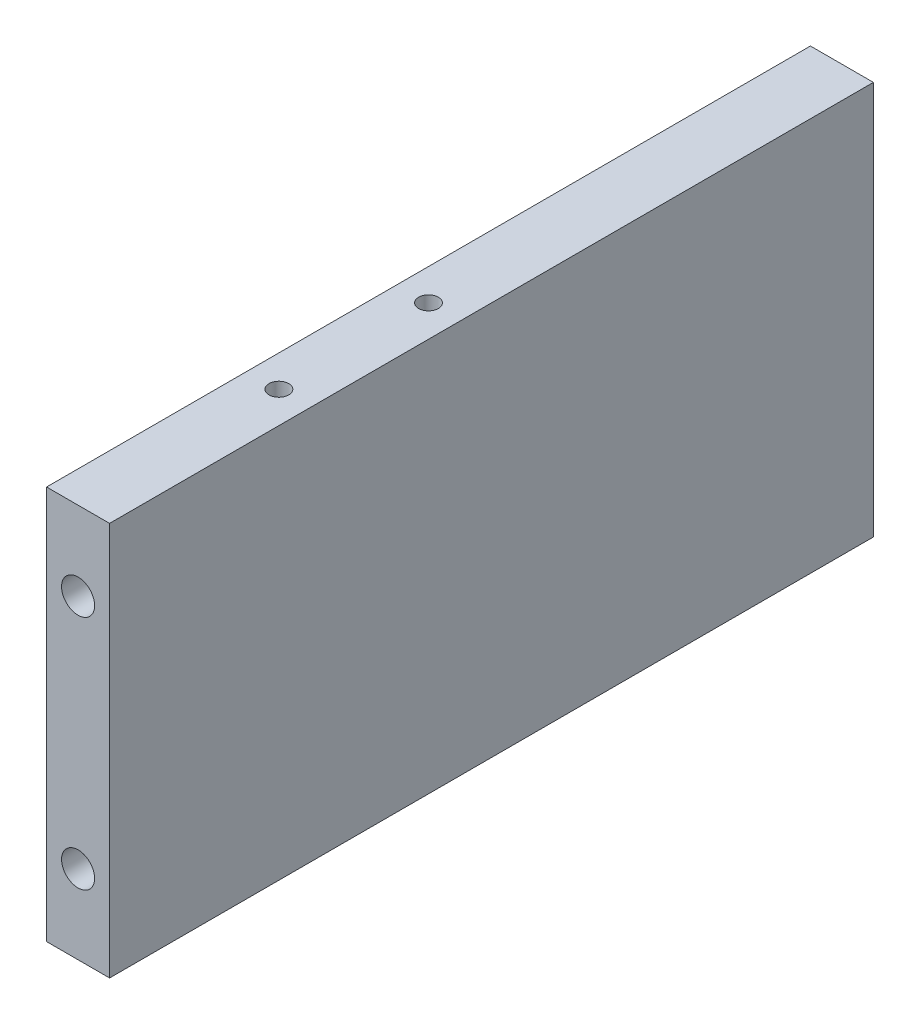
ISO-10303-21;
HEADER;
FILE_DESCRIPTION(('STEP AP214'),'2;1');
FILE_NAME('part.step','',(''),(''),'','','');
FILE_SCHEMA(('AUTOMOTIVE_DESIGN { 1 0 10303 214 1 1 1 1 }'));
ENDSEC;
DATA;
#1=APPLICATION_CONTEXT('core data for automotive mechanical design processes');
#2=APPLICATION_PROTOCOL_DEFINITION('international standard','automotive_design',2000,#1);
#3=PRODUCT_CONTEXT('',#1,'mechanical');
#4=PRODUCT('Part','Part','',(#3));
#5=PRODUCT_RELATED_PRODUCT_CATEGORY('part','',(#4));
#6=PRODUCT_DEFINITION_FORMATION('','',#4);
#7=PRODUCT_DEFINITION_CONTEXT('part definition',#1,'design');
#8=PRODUCT_DEFINITION('design','',#6,#7);
#9=PRODUCT_DEFINITION_SHAPE('','',#8);
#10=(LENGTH_UNIT() NAMED_UNIT(*) SI_UNIT(.MILLI.,.METRE.));
#11=(NAMED_UNIT(*) PLANE_ANGLE_UNIT() SI_UNIT($,.RADIAN.));
#12=(NAMED_UNIT(*) SI_UNIT($,.STERADIAN.) SOLID_ANGLE_UNIT());
#13=UNCERTAINTY_MEASURE_WITH_UNIT(LENGTH_MEASURE(1.E-05),#10,'distance_accuracy_value','');
#14=(GEOMETRIC_REPRESENTATION_CONTEXT(3) GLOBAL_UNCERTAINTY_ASSIGNED_CONTEXT((#13)) GLOBAL_UNIT_ASSIGNED_CONTEXT((#10,
#11,#12)) REPRESENTATION_CONTEXT('',''));
#15=CARTESIAN_POINT('',(0.,0.,0.));
#16=DIRECTION('',(0.,0.,1.));
#17=DIRECTION('',(1.,0.,0.));
#18=AXIS2_PLACEMENT_3D('',#15,#16,#17);
#19=CARTESIAN_POINT('',(0.,0.,97.));
#20=DIRECTION('',(1.,0.,0.));
#21=DIRECTION('',(0.,1.,0.));
#22=AXIS2_PLACEMENT_3D('',#19,#20,#21);
#23=PLANE('',#22);
#24=DIRECTION('',(0.,-1.,0.));
#25=VECTOR('',#24,1.);
#26=CARTESIAN_POINT('',(0.,0.,0.));
#27=LINE('',#26,#25);
#28=CARTESIAN_POINT('',(0.,50.,0.));
#29=VERTEX_POINT('',#28);
#30=CARTESIAN_POINT('',(0.,0.,0.));
#31=VERTEX_POINT('',#30);
#32=EDGE_CURVE('E150',#29,#31,#27,.T.);
#33=ORIENTED_EDGE('',*,*,#32,.T.);
#34=DIRECTION('',(0.,0.,-1.));
#35=VECTOR('',#34,1.);
#36=CARTESIAN_POINT('',(0.,0.,97.));
#37=LINE('',#36,#35);
#38=CARTESIAN_POINT('',(0.,0.,97.));
#39=VERTEX_POINT('',#38);
#40=EDGE_CURVE('E11',#39,#31,#37,.T.);
#41=ORIENTED_EDGE('',*,*,#40,.F.);
#42=DIRECTION('',(0.,-1.,0.));
#43=VECTOR('',#42,1.);
#44=CARTESIAN_POINT('',(0.,0.,97.));
#45=LINE('',#44,#43);
#46=CARTESIAN_POINT('',(0.,50.,97.));
#47=VERTEX_POINT('',#46);
#48=EDGE_CURVE('E151',#47,#39,#45,.T.);
#49=ORIENTED_EDGE('',*,*,#48,.F.);
#50=DIRECTION('',(0.,0.,-1.));
#51=VECTOR('',#50,1.);
#52=CARTESIAN_POINT('',(0.,50.,97.));
#53=LINE('',#52,#51);
#54=EDGE_CURVE('E157',#47,#29,#53,.T.);
#55=ORIENTED_EDGE('',*,*,#54,.T.);
#56=EDGE_LOOP('',(#33,#41,#49,#55));
#57=FACE_BOUND('',#56,.T.);
#58=ADVANCED_FACE('F39',(#57),#23,.F.);
#59=CARTESIAN_POINT('',(0.,0.,97.));
#60=DIRECTION('',(0.,1.,0.));
#61=DIRECTION('',(0.,0.,1.));
#62=AXIS2_PLACEMENT_3D('',#59,#60,#61);
#63=PLANE('',#62);
#64=DIRECTION('',(1.,0.,0.));
#65=VECTOR('',#64,1.);
#66=CARTESIAN_POINT('',(0.,0.,0.));
#67=LINE('',#66,#65);
#68=CARTESIAN_POINT('',(7.99999999999999,0.,0.));
#69=VERTEX_POINT('',#68);
#70=EDGE_CURVE('E160',#31,#69,#67,.T.);
#71=ORIENTED_EDGE('',*,*,#70,.T.);
#72=DIRECTION('',(0.,0.,-1.));
#73=VECTOR('',#72,1.);
#74=CARTESIAN_POINT('',(7.99999999999999,0.,97.));
#75=LINE('',#74,#73);
#76=CARTESIAN_POINT('',(7.99999999999999,0.,97.));
#77=VERTEX_POINT('',#76);
#78=EDGE_CURVE('E47',#77,#69,#75,.T.);
#79=ORIENTED_EDGE('',*,*,#78,.F.);
#80=DIRECTION('',(1.,0.,0.));
#81=VECTOR('',#80,1.);
#82=CARTESIAN_POINT('',(0.,0.,97.));
#83=LINE('',#82,#81);
#84=EDGE_CURVE('E86',#39,#77,#83,.T.);
#85=ORIENTED_EDGE('',*,*,#84,.F.);
#86=ORIENTED_EDGE('',*,*,#40,.T.);
#87=EDGE_LOOP('',(#71,#79,#85,#86));
#88=FACE_BOUND('',#87,.T.);
#89=ADVANCED_FACE('F187',(#88),#63,.F.);
#90=CARTESIAN_POINT('',(7.99999999999999,0.,97.));
#91=DIRECTION('',(-1.,0.,0.));
#92=DIRECTION('',(0.,-1.,0.));
#93=AXIS2_PLACEMENT_3D('',#90,#91,#92);
#94=PLANE('',#93);
#95=DIRECTION('',(0.,1.,0.));
#96=VECTOR('',#95,1.);
#97=CARTESIAN_POINT('',(7.99999999999999,0.,0.));
#98=LINE('',#97,#96);
#99=CARTESIAN_POINT('',(7.99999999999998,50.,0.));
#100=VERTEX_POINT('',#99);
#101=EDGE_CURVE('E73',#69,#100,#98,.T.);
#102=ORIENTED_EDGE('',*,*,#101,.T.);
#103=DIRECTION('',(0.,0.,-1.));
#104=VECTOR('',#103,1.);
#105=CARTESIAN_POINT('',(7.99999999999998,50.,97.));
#106=LINE('',#105,#104);
#107=CARTESIAN_POINT('',(7.99999999999998,50.,97.));
#108=VERTEX_POINT('',#107);
#109=EDGE_CURVE('E165',#108,#100,#106,.T.);
#110=ORIENTED_EDGE('',*,*,#109,.F.);
#111=DIRECTION('',(0.,1.,0.));
#112=VECTOR('',#111,1.);
#113=CARTESIAN_POINT('',(7.99999999999999,0.,97.));
#114=LINE('',#113,#112);
#115=EDGE_CURVE('E154',#77,#108,#114,.T.);
#116=ORIENTED_EDGE('',*,*,#115,.F.);
#117=ORIENTED_EDGE('',*,*,#78,.T.);
#118=EDGE_LOOP('',(#102,#110,#116,#117));
#119=FACE_BOUND('',#118,.T.);
#120=ADVANCED_FACE('F167',(#119),#94,.F.);
#121=CARTESIAN_POINT('',(0.,50.,97.));
#122=DIRECTION('',(0.,-1.,0.));
#123=DIRECTION('',(0.,0.,-1.));
#124=AXIS2_PLACEMENT_3D('',#121,#122,#123);
#125=PLANE('',#124);
#126=CARTESIAN_POINT('',(3.99999999999948,50.,71.5));
#127=DIRECTION('',(0.,1.,0.));
#128=DIRECTION('',(0.,0.,1.));
#129=AXIS2_PLACEMENT_3D('',#126,#127,#128);
#130=CIRCLE('',#129,1.25);
#131=CARTESIAN_POINT('',(3.99999999999948,50.,72.75));
#132=VERTEX_POINT('',#131);
#133=EDGE_CURVE('E116',#132,#132,#130,.T.);
#134=ORIENTED_EDGE('',*,*,#133,.F.);
#135=EDGE_LOOP('',(#134));
#136=FACE_BOUND('',#135,.T.);
#137=CARTESIAN_POINT('',(3.99999999999948,50.,52.5));
#138=DIRECTION('',(0.,1.,0.));
#139=DIRECTION('',(0.,0.,1.));
#140=AXIS2_PLACEMENT_3D('',#137,#138,#139);
#141=CIRCLE('',#140,1.25);
#142=CARTESIAN_POINT('',(3.99999999999948,50.,53.75));
#143=VERTEX_POINT('',#142);
#144=EDGE_CURVE('E115',#143,#143,#141,.T.);
#145=ORIENTED_EDGE('',*,*,#144,.F.);
#146=EDGE_LOOP('',(#145));
#147=FACE_BOUND('',#146,.T.);
#148=DIRECTION('',(-1.,0.,0.));
#149=VECTOR('',#148,1.);
#150=CARTESIAN_POINT('',(0.,50.,0.));
#151=LINE('',#150,#149);
#152=EDGE_CURVE('E79',#100,#29,#151,.T.);
#153=ORIENTED_EDGE('',*,*,#152,.T.);
#154=ORIENTED_EDGE('',*,*,#54,.F.);
#155=DIRECTION('',(-1.,0.,0.));
#156=VECTOR('',#155,1.);
#157=CARTESIAN_POINT('',(0.,50.,97.));
#158=LINE('',#157,#156);
#159=EDGE_CURVE('E55',#108,#47,#158,.T.);
#160=ORIENTED_EDGE('',*,*,#159,.F.);
#161=ORIENTED_EDGE('',*,*,#109,.T.);
#162=EDGE_LOOP('',(#153,#154,#160,#161));
#163=FACE_BOUND('',#162,.T.);
#164=ADVANCED_FACE('F174',(#136,#147,#163),#125,.F.);
#165=CARTESIAN_POINT('',(0.,0.,97.));
#166=DIRECTION('',(0.,0.,-1.));
#167=DIRECTION('',(-1.,0.,0.));
#168=AXIS2_PLACEMENT_3D('',#165,#166,#167);
#169=PLANE('',#168);
#170=CARTESIAN_POINT('',(3.99999999999998,40.,97.));
#171=DIRECTION('',(0.,0.,1.));
#172=DIRECTION('',(1.,0.,0.));
#173=AXIS2_PLACEMENT_3D('',#170,#171,#172);
#174=CIRCLE('',#173,2.09999999999999);
#175=CARTESIAN_POINT('',(6.09999999999997,40.,97.));
#176=VERTEX_POINT('',#175);
#177=EDGE_CURVE('E126',#176,#176,#174,.T.);
#178=ORIENTED_EDGE('',*,*,#177,.F.);
#179=EDGE_LOOP('',(#178));
#180=FACE_BOUND('',#179,.T.);
#181=CARTESIAN_POINT('',(3.99999999999997,10.,97.));
#182=DIRECTION('',(0.,0.,1.));
#183=DIRECTION('',(1.,0.,0.));
#184=AXIS2_PLACEMENT_3D('',#181,#182,#183);
#185=CIRCLE('',#184,2.09999999999999);
#186=CARTESIAN_POINT('',(6.09999999999996,10.,97.));
#187=VERTEX_POINT('',#186);
#188=EDGE_CURVE('E132',#187,#187,#185,.T.);
#189=ORIENTED_EDGE('',*,*,#188,.F.);
#190=EDGE_LOOP('',(#189));
#191=FACE_BOUND('',#190,.T.);
#192=ORIENTED_EDGE('',*,*,#48,.T.);
#193=ORIENTED_EDGE('',*,*,#84,.T.);
#194=ORIENTED_EDGE('',*,*,#115,.T.);
#195=ORIENTED_EDGE('',*,*,#159,.T.);
#196=EDGE_LOOP('',(#192,#193,#194,#195));
#197=FACE_BOUND('',#196,.T.);
#198=ADVANCED_FACE('F176',(#180,#191,#197),#169,.F.);
#199=CARTESIAN_POINT('',(0.,0.,0.));
#200=DIRECTION('',(0.,0.,-1.));
#201=DIRECTION('',(-1.,0.,0.));
#202=AXIS2_PLACEMENT_3D('',#199,#200,#201);
#203=PLANE('',#202);
#204=CARTESIAN_POINT('',(3.99999999999998,40.,0.));
#205=DIRECTION('',(0.,0.,-1.));
#206=DIRECTION('',(-1.,0.,0.));
#207=AXIS2_PLACEMENT_3D('',#204,#205,#206);
#208=CIRCLE('',#207,2.09999999999999);
#209=CARTESIAN_POINT('',(1.89999999999999,40.,0.));
#210=VERTEX_POINT('',#209);
#211=EDGE_CURVE('E138',#210,#210,#208,.T.);
#212=ORIENTED_EDGE('',*,*,#211,.F.);
#213=EDGE_LOOP('',(#212));
#214=FACE_BOUND('',#213,.T.);
#215=CARTESIAN_POINT('',(3.99999999999997,10.,0.));
#216=DIRECTION('',(0.,0.,-1.));
#217=DIRECTION('',(-1.,0.,0.));
#218=AXIS2_PLACEMENT_3D('',#215,#216,#217);
#219=CIRCLE('',#218,2.09999999999999);
#220=CARTESIAN_POINT('',(1.89999999999998,10.,0.));
#221=VERTEX_POINT('',#220);
#222=EDGE_CURVE('E144',#221,#221,#219,.T.);
#223=ORIENTED_EDGE('',*,*,#222,.F.);
#224=EDGE_LOOP('',(#223));
#225=FACE_BOUND('',#224,.T.);
#226=ORIENTED_EDGE('',*,*,#32,.F.);
#227=ORIENTED_EDGE('',*,*,#152,.F.);
#228=ORIENTED_EDGE('',*,*,#101,.F.);
#229=ORIENTED_EDGE('',*,*,#70,.F.);
#230=EDGE_LOOP('',(#226,#227,#228,#229));
#231=FACE_BOUND('',#230,.T.);
#232=ADVANCED_FACE('F170',(#214,#225,#231),#203,.T.);
#233=CARTESIAN_POINT('',(3.99999999999997,10.,12.4));
#234=DIRECTION('',(0.,0.,-1.));
#235=DIRECTION('',(-1.,0.,0.));
#236=AXIS2_PLACEMENT_3D('',#233,#234,#235);
#237=CONICAL_SURFACE('',#236,2.09999999999999,1.02974425867665);
#238=CARTESIAN_POINT('',(3.99999999999997,10.,13.6618072999579));
#239=VERTEX_POINT('',#238);
#240=VERTEX_LOOP('',#239);
#241=FACE_BOUND('',#240,.T.);
#242=CARTESIAN_POINT('',(3.99999999999997,10.,12.4));
#243=DIRECTION('',(0.,0.,-1.));
#244=DIRECTION('',(-1.,0.,0.));
#245=AXIS2_PLACEMENT_3D('',#242,#243,#244);
#246=CIRCLE('',#245,2.09999999999999);
#247=CARTESIAN_POINT('',(1.89999999999998,10.,12.4));
#248=VERTEX_POINT('',#247);
#249=EDGE_CURVE('E147',#248,#248,#246,.T.);
#250=ORIENTED_EDGE('',*,*,#249,.T.);
#251=EDGE_LOOP('',(#250));
#252=FACE_BOUND('',#251,.T.);
#253=ADVANCED_FACE('F218',(#241,#252),#237,.F.);
#254=CARTESIAN_POINT('',(3.99999999999997,10.,0.));
#255=DIRECTION('',(0.,0.,-1.));
#256=DIRECTION('',(-1.,0.,0.));
#257=AXIS2_PLACEMENT_3D('',#254,#255,#256);
#258=CYLINDRICAL_SURFACE('',#257,2.09999999999999);
#259=ORIENTED_EDGE('',*,*,#249,.F.);
#260=EDGE_LOOP('',(#259));
#261=FACE_BOUND('',#260,.T.);
#262=ORIENTED_EDGE('',*,*,#222,.T.);
#263=EDGE_LOOP('',(#262));
#264=FACE_BOUND('',#263,.T.);
#265=ADVANCED_FACE('F225',(#261,#264),#258,.F.);
#266=CARTESIAN_POINT('',(3.99999999999998,40.,12.4));
#267=DIRECTION('',(0.,0.,-1.));
#268=DIRECTION('',(-1.,0.,0.));
#269=AXIS2_PLACEMENT_3D('',#266,#267,#268);
#270=CONICAL_SURFACE('',#269,2.09999999999999,1.02974425867665);
#271=CARTESIAN_POINT('',(3.99999999999997,40.,13.6618072999579));
#272=VERTEX_POINT('',#271);
#273=VERTEX_LOOP('',#272);
#274=FACE_BOUND('',#273,.T.);
#275=CARTESIAN_POINT('',(3.99999999999998,40.,12.4));
#276=DIRECTION('',(0.,0.,-1.));
#277=DIRECTION('',(-1.,0.,0.));
#278=AXIS2_PLACEMENT_3D('',#275,#276,#277);
#279=CIRCLE('',#278,2.09999999999999);
#280=CARTESIAN_POINT('',(1.89999999999999,40.,12.4));
#281=VERTEX_POINT('',#280);
#282=EDGE_CURVE('E141',#281,#281,#279,.T.);
#283=ORIENTED_EDGE('',*,*,#282,.T.);
#284=EDGE_LOOP('',(#283));
#285=FACE_BOUND('',#284,.T.);
#286=ADVANCED_FACE('F234',(#274,#285),#270,.F.);
#287=CARTESIAN_POINT('',(3.99999999999998,40.,0.));
#288=DIRECTION('',(0.,0.,-1.));
#289=DIRECTION('',(-1.,0.,0.));
#290=AXIS2_PLACEMENT_3D('',#287,#288,#289);
#291=CYLINDRICAL_SURFACE('',#290,2.09999999999999);
#292=ORIENTED_EDGE('',*,*,#282,.F.);
#293=EDGE_LOOP('',(#292));
#294=FACE_BOUND('',#293,.T.);
#295=ORIENTED_EDGE('',*,*,#211,.T.);
#296=EDGE_LOOP('',(#295));
#297=FACE_BOUND('',#296,.T.);
#298=ADVANCED_FACE('F243',(#294,#297),#291,.F.);
#299=CARTESIAN_POINT('',(3.99999999999997,10.,84.6));
#300=DIRECTION('',(0.,0.,1.));
#301=DIRECTION('',(1.,0.,0.));
#302=AXIS2_PLACEMENT_3D('',#299,#300,#301);
#303=CONICAL_SURFACE('',#302,2.09999999999999,1.02974425867665);
#304=CARTESIAN_POINT('',(3.99999999999997,10.,83.3381927000421));
#305=VERTEX_POINT('',#304);
#306=VERTEX_LOOP('',#305);
#307=FACE_BOUND('',#306,.T.);
#308=CARTESIAN_POINT('',(3.99999999999997,10.,84.6));
#309=DIRECTION('',(0.,0.,1.));
#310=DIRECTION('',(1.,0.,0.));
#311=AXIS2_PLACEMENT_3D('',#308,#309,#310);
#312=CIRCLE('',#311,2.09999999999999);
#313=CARTESIAN_POINT('',(6.09999999999996,10.,84.6));
#314=VERTEX_POINT('',#313);
#315=EDGE_CURVE('E135',#314,#314,#312,.T.);
#316=ORIENTED_EDGE('',*,*,#315,.T.);
#317=EDGE_LOOP('',(#316));
#318=FACE_BOUND('',#317,.T.);
#319=ADVANCED_FACE('F251',(#307,#318),#303,.F.);
#320=CARTESIAN_POINT('',(3.99999999999997,10.,97.));
#321=DIRECTION('',(0.,0.,1.));
#322=DIRECTION('',(1.,0.,0.));
#323=AXIS2_PLACEMENT_3D('',#320,#321,#322);
#324=CYLINDRICAL_SURFACE('',#323,2.09999999999999);
#325=ORIENTED_EDGE('',*,*,#315,.F.);
#326=EDGE_LOOP('',(#325));
#327=FACE_BOUND('',#326,.T.);
#328=ORIENTED_EDGE('',*,*,#188,.T.);
#329=EDGE_LOOP('',(#328));
#330=FACE_BOUND('',#329,.T.);
#331=ADVANCED_FACE('F259',(#327,#330),#324,.F.);
#332=CARTESIAN_POINT('',(3.99999999999998,40.,84.6));
#333=DIRECTION('',(0.,0.,1.));
#334=DIRECTION('',(1.,0.,0.));
#335=AXIS2_PLACEMENT_3D('',#332,#333,#334);
#336=CONICAL_SURFACE('',#335,2.09999999999999,1.02974425867665);
#337=CARTESIAN_POINT('',(3.99999999999997,40.,83.3381927000421));
#338=VERTEX_POINT('',#337);
#339=VERTEX_LOOP('',#338);
#340=FACE_BOUND('',#339,.T.);
#341=CARTESIAN_POINT('',(3.99999999999998,40.,84.6));
#342=DIRECTION('',(0.,0.,1.));
#343=DIRECTION('',(1.,0.,0.));
#344=AXIS2_PLACEMENT_3D('',#341,#342,#343);
#345=CIRCLE('',#344,2.09999999999999);
#346=CARTESIAN_POINT('',(6.09999999999996,40.,84.6));
#347=VERTEX_POINT('',#346);
#348=EDGE_CURVE('E129',#347,#347,#345,.T.);
#349=ORIENTED_EDGE('',*,*,#348,.T.);
#350=EDGE_LOOP('',(#349));
#351=FACE_BOUND('',#350,.T.);
#352=ADVANCED_FACE('F267',(#340,#351),#336,.F.);
#353=CARTESIAN_POINT('',(3.99999999999998,40.,97.));
#354=DIRECTION('',(0.,0.,1.));
#355=DIRECTION('',(1.,0.,0.));
#356=AXIS2_PLACEMENT_3D('',#353,#354,#355);
#357=CYLINDRICAL_SURFACE('',#356,2.09999999999999);
#358=ORIENTED_EDGE('',*,*,#348,.F.);
#359=EDGE_LOOP('',(#358));
#360=FACE_BOUND('',#359,.T.);
#361=ORIENTED_EDGE('',*,*,#177,.T.);
#362=EDGE_LOOP('',(#361));
#363=FACE_BOUND('',#362,.T.);
#364=ADVANCED_FACE('F275',(#360,#363),#357,.F.);
#365=CARTESIAN_POINT('',(3.99999999999948,42.5,52.5));
#366=DIRECTION('',(0.,1.,0.));
#367=DIRECTION('',(0.,0.,1.));
#368=AXIS2_PLACEMENT_3D('',#365,#366,#367);
#369=CONICAL_SURFACE('',#368,1.25,1.02974425867665);
#370=CARTESIAN_POINT('',(3.99999999999948,41.7489242262155,52.5));
#371=VERTEX_POINT('',#370);
#372=VERTEX_LOOP('',#371);
#373=FACE_BOUND('',#372,.T.);
#374=CARTESIAN_POINT('',(3.99999999999948,42.5,52.5));
#375=DIRECTION('',(0.,1.,0.));
#376=DIRECTION('',(0.,0.,1.));
#377=AXIS2_PLACEMENT_3D('',#374,#375,#376);
#378=CIRCLE('',#377,1.25);
#379=CARTESIAN_POINT('',(3.99999999999948,42.5,53.75));
#380=VERTEX_POINT('',#379);
#381=EDGE_CURVE('E119',#380,#380,#378,.T.);
#382=ORIENTED_EDGE('',*,*,#381,.T.);
#383=EDGE_LOOP('',(#382));
#384=FACE_BOUND('',#383,.T.);
#385=ADVANCED_FACE('F282',(#373,#384),#369,.F.);
#386=CARTESIAN_POINT('',(3.99999999999948,50.,52.5));
#387=DIRECTION('',(0.,1.,0.));
#388=DIRECTION('',(0.,0.,1.));
#389=AXIS2_PLACEMENT_3D('',#386,#387,#388);
#390=CYLINDRICAL_SURFACE('',#389,1.25);
#391=ORIENTED_EDGE('',*,*,#381,.F.);
#392=EDGE_LOOP('',(#391));
#393=FACE_BOUND('',#392,.T.);
#394=ORIENTED_EDGE('',*,*,#144,.T.);
#395=EDGE_LOOP('',(#394));
#396=FACE_BOUND('',#395,.T.);
#397=ADVANCED_FACE('F109',(#393,#396),#390,.F.);
#398=CARTESIAN_POINT('',(3.99999999999948,42.5,71.5));
#399=DIRECTION('',(0.,1.,0.));
#400=DIRECTION('',(0.,0.,1.));
#401=AXIS2_PLACEMENT_3D('',#398,#399,#400);
#402=CONICAL_SURFACE('',#401,1.25,1.02974425867665);
#403=CARTESIAN_POINT('',(3.99999999999948,41.7489242262155,71.5));
#404=VERTEX_POINT('',#403);
#405=VERTEX_LOOP('',#404);
#406=FACE_BOUND('',#405,.T.);
#407=CARTESIAN_POINT('',(3.99999999999948,42.5,71.5));
#408=DIRECTION('',(0.,1.,0.));
#409=DIRECTION('',(0.,0.,1.));
#410=AXIS2_PLACEMENT_3D('',#407,#408,#409);
#411=CIRCLE('',#410,1.25);
#412=CARTESIAN_POINT('',(3.99999999999948,42.5,72.75));
#413=VERTEX_POINT('',#412);
#414=EDGE_CURVE('E113',#413,#413,#411,.T.);
#415=ORIENTED_EDGE('',*,*,#414,.T.);
#416=EDGE_LOOP('',(#415));
#417=FACE_BOUND('',#416,.T.);
#418=ADVANCED_FACE('F105',(#406,#417),#402,.F.);
#419=CARTESIAN_POINT('',(3.99999999999948,50.,71.5));
#420=DIRECTION('',(0.,1.,0.));
#421=DIRECTION('',(0.,0.,1.));
#422=AXIS2_PLACEMENT_3D('',#419,#420,#421);
#423=CYLINDRICAL_SURFACE('',#422,1.25);
#424=ORIENTED_EDGE('',*,*,#414,.F.);
#425=EDGE_LOOP('',(#424));
#426=FACE_BOUND('',#425,.T.);
#427=ORIENTED_EDGE('',*,*,#133,.T.);
#428=EDGE_LOOP('',(#427));
#429=FACE_BOUND('',#428,.T.);
#430=ADVANCED_FACE('F108',(#426,#429),#423,.F.);
#431=CLOSED_SHELL('',(#58,#89,#120,#164,#198,#232,#253,#265,#286,#298,#319,#331,#352,#364,#385,
#397,#418,#430));
#432=MANIFOLD_SOLID_BREP('B2',#431);
#433=ADVANCED_BREP_SHAPE_REPRESENTATION('',(#18,#432),#14);
#434=SHAPE_DEFINITION_REPRESENTATION(#9,#433);
ENDSEC;
END-ISO-10303-21;
